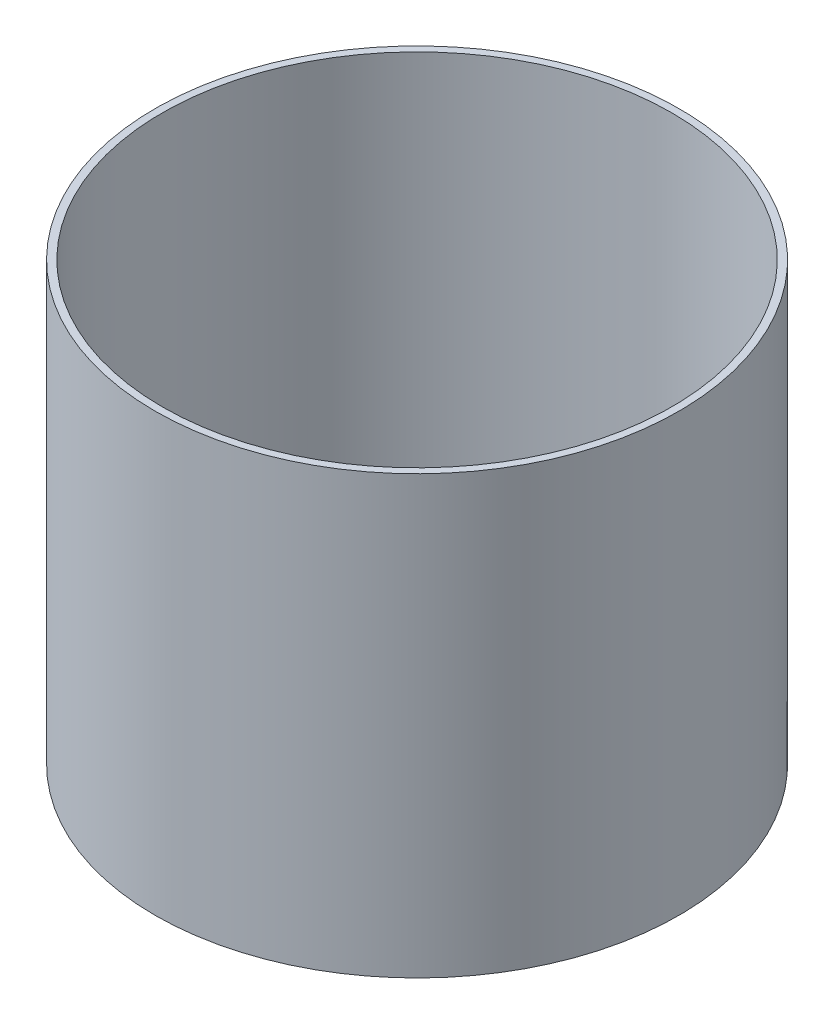
ISO-10303-21;
HEADER;
FILE_DESCRIPTION(('STEP AP214'),'2;1');
FILE_NAME('part.step','',(''),(''),'','','');
FILE_SCHEMA(('AUTOMOTIVE_DESIGN { 1 0 10303 214 1 1 1 1 }'));
ENDSEC;
DATA;
#1=APPLICATION_CONTEXT('core data for automotive mechanical design processes');
#2=APPLICATION_PROTOCOL_DEFINITION('international standard','automotive_design',2000,#1);
#3=PRODUCT_CONTEXT('',#1,'mechanical');
#4=PRODUCT('Part','Part','',(#3));
#5=PRODUCT_RELATED_PRODUCT_CATEGORY('part','',(#4));
#6=PRODUCT_DEFINITION_FORMATION('','',#4);
#7=PRODUCT_DEFINITION_CONTEXT('part definition',#1,'design');
#8=PRODUCT_DEFINITION('design','',#6,#7);
#9=PRODUCT_DEFINITION_SHAPE('','',#8);
#10=(LENGTH_UNIT() NAMED_UNIT(*) SI_UNIT(.MILLI.,.METRE.));
#11=(NAMED_UNIT(*) PLANE_ANGLE_UNIT() SI_UNIT($,.RADIAN.));
#12=(NAMED_UNIT(*) SI_UNIT($,.STERADIAN.) SOLID_ANGLE_UNIT());
#13=UNCERTAINTY_MEASURE_WITH_UNIT(LENGTH_MEASURE(1.E-05),#10,'distance_accuracy_value','');
#14=(GEOMETRIC_REPRESENTATION_CONTEXT(3) GLOBAL_UNCERTAINTY_ASSIGNED_CONTEXT((#13)) GLOBAL_UNIT_ASSIGNED_CONTEXT((#10,
#11,#12)) REPRESENTATION_CONTEXT('',''));
#15=CARTESIAN_POINT('',(0.,0.,0.));
#16=DIRECTION('',(0.,0.,1.));
#17=DIRECTION('',(1.,0.,0.));
#18=AXIS2_PLACEMENT_3D('',#15,#16,#17);
#19=CARTESIAN_POINT('',(0.,60.,0.));
#20=DIRECTION('',(0.,1.,0.));
#21=DIRECTION('',(0.,0.,1.));
#22=AXIS2_PLACEMENT_3D('',#19,#20,#21);
#23=PLANE('',#22);
#24=CARTESIAN_POINT('',(0.,60.,0.));
#25=DIRECTION('',(0.,1.,0.));
#26=DIRECTION('',(0.,0.,1.));
#27=AXIS2_PLACEMENT_3D('',#24,#25,#26);
#28=CIRCLE('',#27,36.);
#29=CARTESIAN_POINT('',(0.,60.,36.));
#30=VERTEX_POINT('',#29);
#31=EDGE_CURVE('E10',#30,#30,#28,.T.);
#32=ORIENTED_EDGE('',*,*,#31,.T.);
#33=EDGE_LOOP('',(#32));
#34=FACE_BOUND('',#33,.T.);
#35=CARTESIAN_POINT('',(0.,60.,0.));
#36=DIRECTION('',(0.,1.,0.));
#37=DIRECTION('',(0.,0.,1.));
#38=AXIS2_PLACEMENT_3D('',#35,#36,#37);
#39=CIRCLE('',#38,35.);
#40=CARTESIAN_POINT('',(0.,60.,35.));
#41=VERTEX_POINT('',#40);
#42=EDGE_CURVE('E54',#41,#41,#39,.T.);
#43=ORIENTED_EDGE('',*,*,#42,.F.);
#44=EDGE_LOOP('',(#43));
#45=FACE_BOUND('',#44,.T.);
#46=ADVANCED_FACE('F41',(#34,#45),#23,.T.);
#47=CARTESIAN_POINT('',(0.,0.,0.));
#48=DIRECTION('',(0.,1.,0.));
#49=DIRECTION('',(0.,0.,1.));
#50=AXIS2_PLACEMENT_3D('',#47,#48,#49);
#51=PLANE('',#50);
#52=CARTESIAN_POINT('',(0.,0.,0.));
#53=DIRECTION('',(0.,1.,0.));
#54=DIRECTION('',(0.,0.,1.));
#55=AXIS2_PLACEMENT_3D('',#52,#53,#54);
#56=CIRCLE('',#55,36.);
#57=CARTESIAN_POINT('',(0.,0.,36.));
#58=VERTEX_POINT('',#57);
#59=EDGE_CURVE('E45',#58,#58,#56,.T.);
#60=ORIENTED_EDGE('',*,*,#59,.F.);
#61=EDGE_LOOP('',(#60));
#62=FACE_BOUND('',#61,.T.);
#63=CARTESIAN_POINT('',(0.,0.,0.));
#64=DIRECTION('',(0.,1.,0.));
#65=DIRECTION('',(0.,0.,1.));
#66=AXIS2_PLACEMENT_3D('',#63,#64,#65);
#67=CIRCLE('',#66,35.);
#68=CARTESIAN_POINT('',(0.,0.,35.));
#69=VERTEX_POINT('',#68);
#70=EDGE_CURVE('E56',#69,#69,#67,.T.);
#71=ORIENTED_EDGE('',*,*,#70,.T.);
#72=EDGE_LOOP('',(#71));
#73=FACE_BOUND('',#72,.T.);
#74=ADVANCED_FACE('F68',(#62,#73),#51,.F.);
#75=CARTESIAN_POINT('',(0.,60.,0.));
#76=DIRECTION('',(0.,-1.,0.));
#77=DIRECTION('',(0.,0.,-1.));
#78=AXIS2_PLACEMENT_3D('',#75,#76,#77);
#79=CYLINDRICAL_SURFACE('',#78,36.);
#80=ORIENTED_EDGE('',*,*,#31,.F.);
#81=EDGE_LOOP('',(#80));
#82=FACE_BOUND('',#81,.T.);
#83=ORIENTED_EDGE('',*,*,#59,.T.);
#84=EDGE_LOOP('',(#83));
#85=FACE_BOUND('',#84,.T.);
#86=ADVANCED_FACE('F43',(#82,#85),#79,.T.);
#87=CARTESIAN_POINT('',(0.,60.,0.));
#88=DIRECTION('',(0.,-1.,0.));
#89=DIRECTION('',(0.,0.,-1.));
#90=AXIS2_PLACEMENT_3D('',#87,#88,#89);
#91=CYLINDRICAL_SURFACE('',#90,35.);
#92=ORIENTED_EDGE('',*,*,#42,.T.);
#93=EDGE_LOOP('',(#92));
#94=FACE_BOUND('',#93,.T.);
#95=ORIENTED_EDGE('',*,*,#70,.F.);
#96=EDGE_LOOP('',(#95));
#97=FACE_BOUND('',#96,.T.);
#98=ADVANCED_FACE('F64',(#94,#97),#91,.F.);
#99=CLOSED_SHELL('',(#46,#74,#86,#98));
#100=MANIFOLD_SOLID_BREP('B2',#99);
#101=ADVANCED_BREP_SHAPE_REPRESENTATION('',(#18,#100),#14);
#102=SHAPE_DEFINITION_REPRESENTATION(#9,#101);
ENDSEC;
END-ISO-10303-21;
